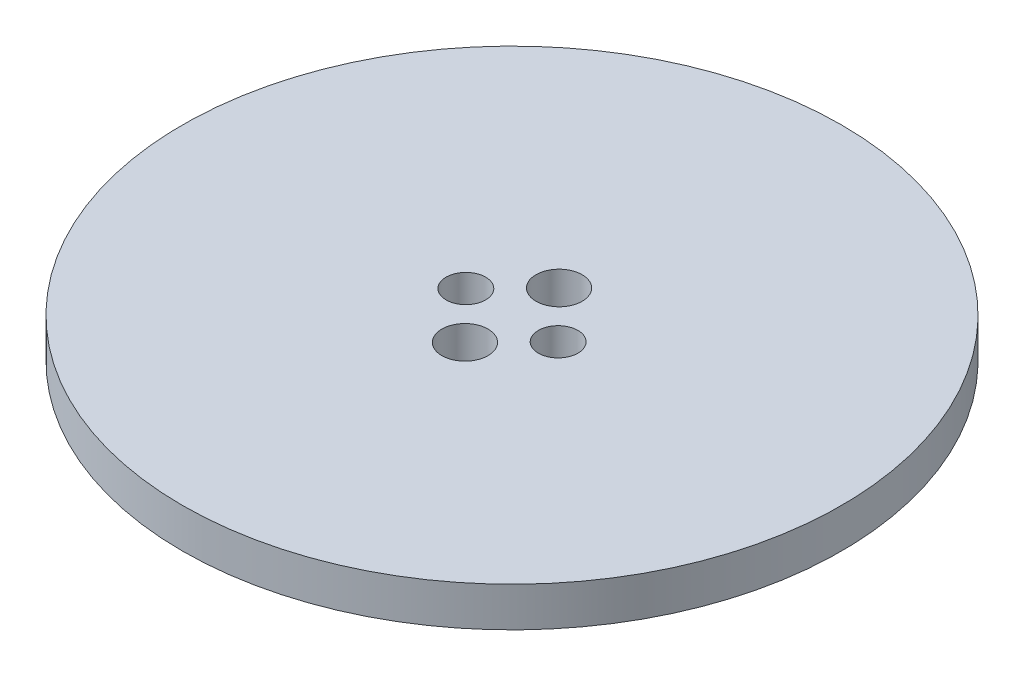
ISO-10303-21;
HEADER;
FILE_DESCRIPTION(('STEP AP214'),'2;1');
FILE_NAME('part.step','',(''),(''),'','','');
FILE_SCHEMA(('AUTOMOTIVE_DESIGN { 1 0 10303 214 1 1 1 1 }'));
ENDSEC;
DATA;
#1=APPLICATION_CONTEXT('core data for automotive mechanical design processes');
#2=APPLICATION_PROTOCOL_DEFINITION('international standard','automotive_design',2000,#1);
#3=PRODUCT_CONTEXT('',#1,'mechanical');
#4=PRODUCT('Part','Part','',(#3));
#5=PRODUCT_RELATED_PRODUCT_CATEGORY('part','',(#4));
#6=PRODUCT_DEFINITION_FORMATION('','',#4);
#7=PRODUCT_DEFINITION_CONTEXT('part definition',#1,'design');
#8=PRODUCT_DEFINITION('design','',#6,#7);
#9=PRODUCT_DEFINITION_SHAPE('','',#8);
#10=(LENGTH_UNIT() NAMED_UNIT(*) SI_UNIT(.MILLI.,.METRE.));
#11=(NAMED_UNIT(*) PLANE_ANGLE_UNIT() SI_UNIT($,.RADIAN.));
#12=(NAMED_UNIT(*) SI_UNIT($,.STERADIAN.) SOLID_ANGLE_UNIT());
#13=UNCERTAINTY_MEASURE_WITH_UNIT(LENGTH_MEASURE(1.E-05),#10,'distance_accuracy_value','');
#14=(GEOMETRIC_REPRESENTATION_CONTEXT(3) GLOBAL_UNCERTAINTY_ASSIGNED_CONTEXT((#13)) GLOBAL_UNIT_ASSIGNED_CONTEXT((#10,
#11,#12)) REPRESENTATION_CONTEXT('',''));
#15=CARTESIAN_POINT('',(0.,0.,0.));
#16=DIRECTION('',(0.,0.,1.));
#17=DIRECTION('',(1.,0.,0.));
#18=AXIS2_PLACEMENT_3D('',#15,#16,#17);
#19=CARTESIAN_POINT('',(0.,3.,0.));
#20=DIRECTION('',(0.,1.,0.));
#21=DIRECTION('',(0.,0.,1.));
#22=AXIS2_PLACEMENT_3D('',#19,#20,#21);
#23=PLANE('',#22);
#24=CARTESIAN_POINT('',(0.,3.,-3.57071421427143));
#25=DIRECTION('',(0.,1.,0.));
#26=DIRECTION('',(0.,0.,1.));
#27=AXIS2_PLACEMENT_3D('',#24,#25,#26);
#28=CIRCLE('',#27,1.75);
#29=CARTESIAN_POINT('',(0.,3.,-1.82071421427143));
#30=VERTEX_POINT('',#29);
#31=EDGE_CURVE('E53',#30,#30,#28,.T.);
#32=ORIENTED_EDGE('',*,*,#31,.F.);
#33=EDGE_LOOP('',(#32));
#34=FACE_BOUND('',#33,.T.);
#35=CARTESIAN_POINT('',(-3.5,3.,0.));
#36=DIRECTION('',(0.,1.,0.));
#37=DIRECTION('',(0.,0.,1.));
#38=AXIS2_PLACEMENT_3D('',#35,#36,#37);
#39=CIRCLE('',#38,1.5);
#40=CARTESIAN_POINT('',(-3.5,3.,1.5));
#41=VERTEX_POINT('',#40);
#42=EDGE_CURVE('E42',#41,#41,#39,.T.);
#43=ORIENTED_EDGE('',*,*,#42,.F.);
#44=EDGE_LOOP('',(#43));
#45=FACE_BOUND('',#44,.T.);
#46=CARTESIAN_POINT('',(0.,3.,0.));
#47=DIRECTION('',(0.,1.,0.));
#48=DIRECTION('',(0.,0.,1.));
#49=AXIS2_PLACEMENT_3D('',#46,#47,#48);
#50=CIRCLE('',#49,25.);
#51=CARTESIAN_POINT('',(0.,3.,25.));
#52=VERTEX_POINT('',#51);
#53=EDGE_CURVE('E10',#52,#52,#50,.T.);
#54=ORIENTED_EDGE('',*,*,#53,.T.);
#55=EDGE_LOOP('',(#54));
#56=FACE_BOUND('',#55,.T.);
#57=CARTESIAN_POINT('',(3.5,3.,0.));
#58=DIRECTION('',(0.,1.,0.));
#59=DIRECTION('',(0.,0.,1.));
#60=AXIS2_PLACEMENT_3D('',#57,#58,#59);
#61=CIRCLE('',#60,1.5);
#62=CARTESIAN_POINT('',(3.5,3.,1.5));
#63=VERTEX_POINT('',#62);
#64=EDGE_CURVE('E47',#63,#63,#61,.T.);
#65=ORIENTED_EDGE('',*,*,#64,.F.);
#66=EDGE_LOOP('',(#65));
#67=FACE_BOUND('',#66,.T.);
#68=CARTESIAN_POINT('',(0.,3.,3.57071421427143));
#69=DIRECTION('',(0.,1.,0.));
#70=DIRECTION('',(0.,0.,1.));
#71=AXIS2_PLACEMENT_3D('',#68,#69,#70);
#72=CIRCLE('',#71,1.75);
#73=CARTESIAN_POINT('',(0.,3.,5.32071421427143));
#74=VERTEX_POINT('',#73);
#75=EDGE_CURVE('E59',#74,#74,#72,.T.);
#76=ORIENTED_EDGE('',*,*,#75,.F.);
#77=EDGE_LOOP('',(#76));
#78=FACE_BOUND('',#77,.T.);
#79=ADVANCED_FACE('F31',(#34,#45,#56,#67,#78),#23,.T.);
#80=CARTESIAN_POINT('',(0.,0.,0.));
#81=DIRECTION('',(0.,1.,0.));
#82=DIRECTION('',(0.,0.,1.));
#83=AXIS2_PLACEMENT_3D('',#80,#81,#82);
#84=PLANE('',#83);
#85=CARTESIAN_POINT('',(0.,0.,0.));
#86=DIRECTION('',(0.,1.,0.));
#87=DIRECTION('',(0.,0.,1.));
#88=AXIS2_PLACEMENT_3D('',#85,#86,#87);
#89=CIRCLE('',#88,25.);
#90=CARTESIAN_POINT('',(0.,0.,25.));
#91=VERTEX_POINT('',#90);
#92=EDGE_CURVE('E35',#91,#91,#89,.T.);
#93=ORIENTED_EDGE('',*,*,#92,.F.);
#94=EDGE_LOOP('',(#93));
#95=FACE_BOUND('',#94,.T.);
#96=CARTESIAN_POINT('',(-3.5,0.,0.));
#97=DIRECTION('',(0.,1.,0.));
#98=DIRECTION('',(0.,0.,1.));
#99=AXIS2_PLACEMENT_3D('',#96,#97,#98);
#100=CIRCLE('',#99,1.5);
#101=CARTESIAN_POINT('',(-3.5,0.,1.5));
#102=VERTEX_POINT('',#101);
#103=EDGE_CURVE('E44',#102,#102,#100,.T.);
#104=ORIENTED_EDGE('',*,*,#103,.T.);
#105=EDGE_LOOP('',(#104));
#106=FACE_BOUND('',#105,.T.);
#107=CARTESIAN_POINT('',(3.5,0.,0.));
#108=DIRECTION('',(0.,1.,0.));
#109=DIRECTION('',(0.,0.,1.));
#110=AXIS2_PLACEMENT_3D('',#107,#108,#109);
#111=CIRCLE('',#110,1.5);
#112=CARTESIAN_POINT('',(3.5,0.,1.5));
#113=VERTEX_POINT('',#112);
#114=EDGE_CURVE('E50',#113,#113,#111,.T.);
#115=ORIENTED_EDGE('',*,*,#114,.T.);
#116=EDGE_LOOP('',(#115));
#117=FACE_BOUND('',#116,.T.);
#118=CARTESIAN_POINT('',(0.,0.,-3.57071421427143));
#119=DIRECTION('',(0.,1.,0.));
#120=DIRECTION('',(0.,0.,1.));
#121=AXIS2_PLACEMENT_3D('',#118,#119,#120);
#122=CIRCLE('',#121,1.75);
#123=CARTESIAN_POINT('',(0.,0.,-1.82071421427143));
#124=VERTEX_POINT('',#123);
#125=EDGE_CURVE('E56',#124,#124,#122,.T.);
#126=ORIENTED_EDGE('',*,*,#125,.T.);
#127=EDGE_LOOP('',(#126));
#128=FACE_BOUND('',#127,.T.);
#129=CARTESIAN_POINT('',(0.,0.,3.57071421427143));
#130=DIRECTION('',(0.,1.,0.));
#131=DIRECTION('',(0.,0.,1.));
#132=AXIS2_PLACEMENT_3D('',#129,#130,#131);
#133=CIRCLE('',#132,1.75);
#134=CARTESIAN_POINT('',(0.,0.,5.32071421427143));
#135=VERTEX_POINT('',#134);
#136=EDGE_CURVE('E62',#135,#135,#133,.T.);
#137=ORIENTED_EDGE('',*,*,#136,.T.);
#138=EDGE_LOOP('',(#137));
#139=FACE_BOUND('',#138,.T.);
#140=ADVANCED_FACE('F72',(#95,#106,#117,#128,#139),#84,.F.);
#141=CARTESIAN_POINT('',(0.,3.,0.));
#142=DIRECTION('',(0.,-1.,0.));
#143=DIRECTION('',(0.,0.,-1.));
#144=AXIS2_PLACEMENT_3D('',#141,#142,#143);
#145=CYLINDRICAL_SURFACE('',#144,25.);
#146=ORIENTED_EDGE('',*,*,#53,.F.);
#147=EDGE_LOOP('',(#146));
#148=FACE_BOUND('',#147,.T.);
#149=ORIENTED_EDGE('',*,*,#92,.T.);
#150=EDGE_LOOP('',(#149));
#151=FACE_BOUND('',#150,.T.);
#152=ADVANCED_FACE('F33',(#148,#151),#145,.T.);
#153=CARTESIAN_POINT('',(-3.5,3.,0.));
#154=DIRECTION('',(0.,-1.,0.));
#155=DIRECTION('',(0.,0.,-1.));
#156=AXIS2_PLACEMENT_3D('',#153,#154,#155);
#157=CYLINDRICAL_SURFACE('',#156,1.5);
#158=ORIENTED_EDGE('',*,*,#42,.T.);
#159=EDGE_LOOP('',(#158));
#160=FACE_BOUND('',#159,.T.);
#161=ORIENTED_EDGE('',*,*,#103,.F.);
#162=EDGE_LOOP('',(#161));
#163=FACE_BOUND('',#162,.T.);
#164=ADVANCED_FACE('F82',(#160,#163),#157,.F.);
#165=CARTESIAN_POINT('',(3.5,3.,0.));
#166=DIRECTION('',(0.,-1.,0.));
#167=DIRECTION('',(0.,0.,-1.));
#168=AXIS2_PLACEMENT_3D('',#165,#166,#167);
#169=CYLINDRICAL_SURFACE('',#168,1.5);
#170=ORIENTED_EDGE('',*,*,#64,.T.);
#171=EDGE_LOOP('',(#170));
#172=FACE_BOUND('',#171,.T.);
#173=ORIENTED_EDGE('',*,*,#114,.F.);
#174=EDGE_LOOP('',(#173));
#175=FACE_BOUND('',#174,.T.);
#176=ADVANCED_FACE('F85',(#172,#175),#169,.F.);
#177=CARTESIAN_POINT('',(0.,3.,-3.57071421427143));
#178=DIRECTION('',(0.,-1.,0.));
#179=DIRECTION('',(0.,0.,-1.));
#180=AXIS2_PLACEMENT_3D('',#177,#178,#179);
#181=CYLINDRICAL_SURFACE('',#180,1.75);
#182=ORIENTED_EDGE('',*,*,#31,.T.);
#183=EDGE_LOOP('',(#182));
#184=FACE_BOUND('',#183,.T.);
#185=ORIENTED_EDGE('',*,*,#125,.F.);
#186=EDGE_LOOP('',(#185));
#187=FACE_BOUND('',#186,.T.);
#188=ADVANCED_FACE('F89',(#184,#187),#181,.F.);
#189=CARTESIAN_POINT('',(0.,3.,3.57071421427143));
#190=DIRECTION('',(0.,-1.,0.));
#191=DIRECTION('',(0.,0.,-1.));
#192=AXIS2_PLACEMENT_3D('',#189,#190,#191);
#193=CYLINDRICAL_SURFACE('',#192,1.75);
#194=ORIENTED_EDGE('',*,*,#75,.T.);
#195=EDGE_LOOP('',(#194));
#196=FACE_BOUND('',#195,.T.);
#197=ORIENTED_EDGE('',*,*,#136,.F.);
#198=EDGE_LOOP('',(#197));
#199=FACE_BOUND('',#198,.T.);
#200=ADVANCED_FACE('F68',(#196,#199),#193,.F.);
#201=CLOSED_SHELL('',(#79,#140,#152,#164,#176,#188,#200));
#202=MANIFOLD_SOLID_BREP('B2',#201);
#203=ADVANCED_BREP_SHAPE_REPRESENTATION('',(#18,#202),#14);
#204=SHAPE_DEFINITION_REPRESENTATION(#9,#203);
ENDSEC;
END-ISO-10303-21;
